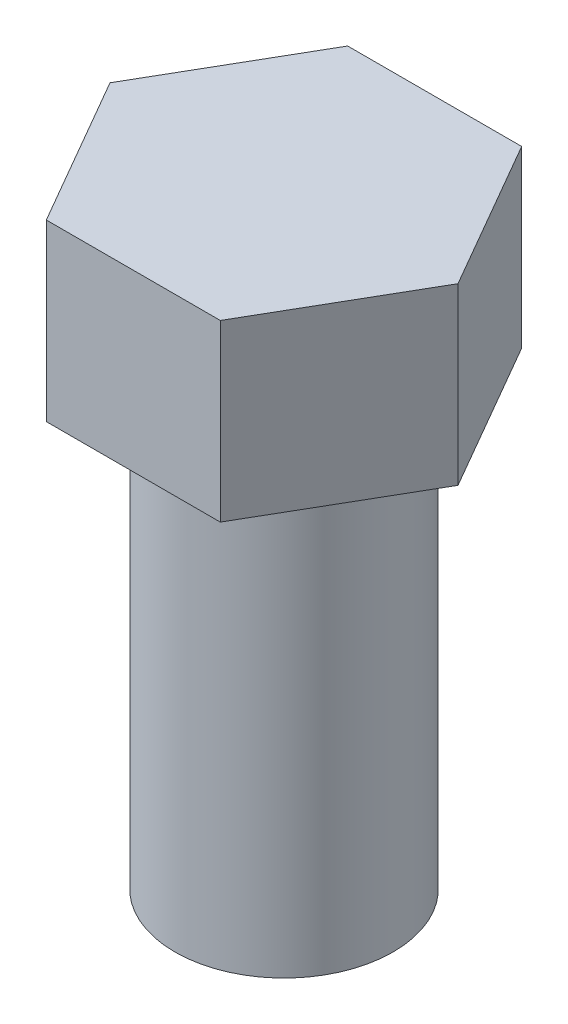
ISO-10303-21;
HEADER;
FILE_DESCRIPTION(('STEP AP214'),'2;1');
FILE_NAME('part.step','',(''),(''),'','','');
FILE_SCHEMA(('AUTOMOTIVE_DESIGN { 1 0 10303 214 1 1 1 1 }'));
ENDSEC;
DATA;
#1=APPLICATION_CONTEXT('core data for automotive mechanical design processes');
#2=APPLICATION_PROTOCOL_DEFINITION('international standard','automotive_design',2000,#1);
#3=PRODUCT_CONTEXT('',#1,'mechanical');
#4=PRODUCT('Part','Part','',(#3));
#5=PRODUCT_RELATED_PRODUCT_CATEGORY('part','',(#4));
#6=PRODUCT_DEFINITION_FORMATION('','',#4);
#7=PRODUCT_DEFINITION_CONTEXT('part definition',#1,'design');
#8=PRODUCT_DEFINITION('design','',#6,#7);
#9=PRODUCT_DEFINITION_SHAPE('','',#8);
#10=(LENGTH_UNIT() NAMED_UNIT(*) SI_UNIT(.MILLI.,.METRE.));
#11=(NAMED_UNIT(*) PLANE_ANGLE_UNIT() SI_UNIT($,.RADIAN.));
#12=(NAMED_UNIT(*) SI_UNIT($,.STERADIAN.) SOLID_ANGLE_UNIT());
#13=UNCERTAINTY_MEASURE_WITH_UNIT(LENGTH_MEASURE(1.E-05),#10,'distance_accuracy_value','');
#14=(GEOMETRIC_REPRESENTATION_CONTEXT(3) GLOBAL_UNCERTAINTY_ASSIGNED_CONTEXT((#13)) GLOBAL_UNIT_ASSIGNED_CONTEXT((#10,
#11,#12)) REPRESENTATION_CONTEXT('',''));
#15=CARTESIAN_POINT('',(0.,0.,0.));
#16=DIRECTION('',(0.,0.,1.));
#17=DIRECTION('',(1.,0.,0.));
#18=AXIS2_PLACEMENT_3D('',#15,#16,#17);
#19=CARTESIAN_POINT('',(0.,-254.,0.));
#20=DIRECTION('',(0.,1.,0.));
#21=DIRECTION('',(0.,0.,1.));
#22=AXIS2_PLACEMENT_3D('',#19,#20,#21);
#23=CYLINDRICAL_SURFACE('',#22,63.5);
#24=CARTESIAN_POINT('',(0.,-254.,0.));
#25=DIRECTION('',(0.,1.,0.));
#26=DIRECTION('',(0.,0.,1.));
#27=AXIS2_PLACEMENT_3D('',#24,#25,#26);
#28=CIRCLE('',#27,63.5);
#29=CARTESIAN_POINT('',(0.,-254.,63.5));
#30=VERTEX_POINT('',#29);
#31=EDGE_CURVE('E13',#30,#30,#28,.T.);
#32=ORIENTED_EDGE('',*,*,#31,.T.);
#33=EDGE_LOOP('',(#32));
#34=FACE_BOUND('',#33,.T.);
#35=CARTESIAN_POINT('',(0.,0.,0.));
#36=DIRECTION('',(0.,1.,0.));
#37=DIRECTION('',(0.,0.,1.));
#38=AXIS2_PLACEMENT_3D('',#35,#36,#37);
#39=CIRCLE('',#38,63.5);
#40=CARTESIAN_POINT('',(0.,0.,63.5));
#41=VERTEX_POINT('',#40);
#42=EDGE_CURVE('E47',#41,#41,#39,.T.);
#43=ORIENTED_EDGE('',*,*,#42,.F.);
#44=EDGE_LOOP('',(#43));
#45=FACE_BOUND('',#44,.T.);
#46=ADVANCED_FACE('F44',(#34,#45),#23,.T.);
#47=CARTESIAN_POINT('',(0.,-254.,0.));
#48=DIRECTION('',(0.,1.,0.));
#49=DIRECTION('',(0.,0.,1.));
#50=AXIS2_PLACEMENT_3D('',#47,#48,#49);
#51=PLANE('',#50);
#52=ORIENTED_EDGE('',*,*,#31,.F.);
#53=EDGE_LOOP('',(#52));
#54=FACE_BOUND('',#53,.T.);
#55=ADVANCED_FACE('F155',(#54),#51,.F.);
#56=CARTESIAN_POINT('',(-101.227340711628,101.6,0.));
#57=DIRECTION('',(0.866025403784439,0.,0.5));
#58=DIRECTION('',(0.5,0.,-0.866025403784439));
#59=AXIS2_PLACEMENT_3D('',#56,#57,#58);
#60=PLANE('',#59);
#61=DIRECTION('',(-0.5,0.,0.866025403784439));
#62=VECTOR('',#61,1.);
#63=CARTESIAN_POINT('',(-101.227340711628,0.,0.));
#64=LINE('',#63,#62);
#65=CARTESIAN_POINT('',(-50.6136703558138,0.,-87.6654486138122));
#66=VERTEX_POINT('',#65);
#67=CARTESIAN_POINT('',(-101.227340711628,0.,0.));
#68=VERTEX_POINT('',#67);
#69=EDGE_CURVE('E129',#66,#68,#64,.T.);
#70=ORIENTED_EDGE('',*,*,#69,.T.);
#71=DIRECTION('',(0.,-1.,0.));
#72=VECTOR('',#71,1.);
#73=CARTESIAN_POINT('',(-101.227340711628,101.6,0.));
#74=LINE('',#73,#72);
#75=CARTESIAN_POINT('',(-101.227340711628,101.6,0.));
#76=VERTEX_POINT('',#75);
#77=EDGE_CURVE('E146',#76,#68,#74,.T.);
#78=ORIENTED_EDGE('',*,*,#77,.F.);
#79=DIRECTION('',(-0.5,0.,0.866025403784439));
#80=VECTOR('',#79,1.);
#81=CARTESIAN_POINT('',(-101.227340711628,101.6,0.));
#82=LINE('',#81,#80);
#83=CARTESIAN_POINT('',(-50.6136703558138,101.6,-87.6654486138122));
#84=VERTEX_POINT('',#83);
#85=EDGE_CURVE('E139',#84,#76,#82,.T.);
#86=ORIENTED_EDGE('',*,*,#85,.F.);
#87=DIRECTION('',(0.,-1.,0.));
#88=VECTOR('',#87,1.);
#89=CARTESIAN_POINT('',(-50.6136703558138,101.6,-87.6654486138122));
#90=LINE('',#89,#88);
#91=EDGE_CURVE('E125',#84,#66,#90,.T.);
#92=ORIENTED_EDGE('',*,*,#91,.T.);
#93=EDGE_LOOP('',(#70,#78,#86,#92));
#94=FACE_BOUND('',#93,.T.);
#95=ADVANCED_FACE('F160',(#94),#60,.F.);
#96=CARTESIAN_POINT('',(-50.6136703558138,101.6,87.6654486138122));
#97=DIRECTION('',(0.866025403784439,0.,-0.5));
#98=DIRECTION('',(-0.5,0.,-0.866025403784439));
#99=AXIS2_PLACEMENT_3D('',#96,#97,#98);
#100=PLANE('',#99);
#101=DIRECTION('',(0.5,0.,0.866025403784439));
#102=VECTOR('',#101,1.);
#103=CARTESIAN_POINT('',(-50.6136703558138,0.,87.6654486138122));
#104=LINE('',#103,#102);
#105=CARTESIAN_POINT('',(-50.6136703558138,0.,87.6654486138122));
#106=VERTEX_POINT('',#105);
#107=EDGE_CURVE('E132',#68,#106,#104,.T.);
#108=ORIENTED_EDGE('',*,*,#107,.T.);
#109=DIRECTION('',(0.,-1.,0.));
#110=VECTOR('',#109,1.);
#111=CARTESIAN_POINT('',(-50.6136703558138,101.6,87.6654486138122));
#112=LINE('',#111,#110);
#113=CARTESIAN_POINT('',(-50.6136703558138,101.6,87.6654486138122));
#114=VERTEX_POINT('',#113);
#115=EDGE_CURVE('E143',#114,#106,#112,.T.);
#116=ORIENTED_EDGE('',*,*,#115,.F.);
#117=DIRECTION('',(0.5,0.,0.866025403784439));
#118=VECTOR('',#117,1.);
#119=CARTESIAN_POINT('',(-50.6136703558138,101.6,87.6654486138122));
#120=LINE('',#119,#118);
#121=EDGE_CURVE('E98',#76,#114,#120,.T.);
#122=ORIENTED_EDGE('',*,*,#121,.F.);
#123=ORIENTED_EDGE('',*,*,#77,.T.);
#124=EDGE_LOOP('',(#108,#116,#122,#123));
#125=FACE_BOUND('',#124,.T.);
#126=ADVANCED_FACE('F166',(#125),#100,.F.);
#127=CARTESIAN_POINT('',(50.6136703558138,101.6,87.6654486138122));
#128=DIRECTION('',(0.,0.,-1.));
#129=DIRECTION('',(-1.,0.,0.));
#130=AXIS2_PLACEMENT_3D('',#127,#128,#129);
#131=PLANE('',#130);
#132=DIRECTION('',(1.,0.,0.));
#133=VECTOR('',#132,1.);
#134=CARTESIAN_POINT('',(50.6136703558138,0.,87.6654486138122));
#135=LINE('',#134,#133);
#136=CARTESIAN_POINT('',(50.6136703558138,0.,87.6654486138122));
#137=VERTEX_POINT('',#136);
#138=EDGE_CURVE('E134',#106,#137,#135,.T.);
#139=ORIENTED_EDGE('',*,*,#138,.T.);
#140=DIRECTION('',(0.,-1.,0.));
#141=VECTOR('',#140,1.);
#142=CARTESIAN_POINT('',(50.6136703558138,101.6,87.6654486138122));
#143=LINE('',#142,#141);
#144=CARTESIAN_POINT('',(50.6136703558138,101.6,87.6654486138122));
#145=VERTEX_POINT('',#144);
#146=EDGE_CURVE('E120',#145,#137,#143,.T.);
#147=ORIENTED_EDGE('',*,*,#146,.F.);
#148=DIRECTION('',(1.,0.,0.));
#149=VECTOR('',#148,1.);
#150=CARTESIAN_POINT('',(50.6136703558138,101.6,87.6654486138122));
#151=LINE('',#150,#149);
#152=EDGE_CURVE('E111',#114,#145,#151,.T.);
#153=ORIENTED_EDGE('',*,*,#152,.F.);
#154=ORIENTED_EDGE('',*,*,#115,.T.);
#155=EDGE_LOOP('',(#139,#147,#153,#154));
#156=FACE_BOUND('',#155,.T.);
#157=ADVANCED_FACE('F172',(#156),#131,.F.);
#158=CARTESIAN_POINT('',(101.227340711628,101.6,0.));
#159=DIRECTION('',(-0.866025403784439,0.,-0.5));
#160=DIRECTION('',(-0.5,0.,0.866025403784439));
#161=AXIS2_PLACEMENT_3D('',#158,#159,#160);
#162=PLANE('',#161);
#163=DIRECTION('',(0.5,0.,-0.866025403784438));
#164=VECTOR('',#163,1.);
#165=CARTESIAN_POINT('',(101.227340711628,0.,0.));
#166=LINE('',#165,#164);
#167=CARTESIAN_POINT('',(101.227340711628,0.,0.));
#168=VERTEX_POINT('',#167);
#169=EDGE_CURVE('E119',#137,#168,#166,.T.);
#170=ORIENTED_EDGE('',*,*,#169,.T.);
#171=DIRECTION('',(0.,-1.,0.));
#172=VECTOR('',#171,1.);
#173=CARTESIAN_POINT('',(101.227340711628,101.6,0.));
#174=LINE('',#173,#172);
#175=CARTESIAN_POINT('',(101.227340711628,101.6,0.));
#176=VERTEX_POINT('',#175);
#177=EDGE_CURVE('E116',#176,#168,#174,.T.);
#178=ORIENTED_EDGE('',*,*,#177,.F.);
#179=DIRECTION('',(0.5,0.,-0.866025403784438));
#180=VECTOR('',#179,1.);
#181=CARTESIAN_POINT('',(101.227340711628,101.6,0.));
#182=LINE('',#181,#180);
#183=EDGE_CURVE('E105',#145,#176,#182,.T.);
#184=ORIENTED_EDGE('',*,*,#183,.F.);
#185=ORIENTED_EDGE('',*,*,#146,.T.);
#186=EDGE_LOOP('',(#170,#178,#184,#185));
#187=FACE_BOUND('',#186,.T.);
#188=ADVANCED_FACE('F117',(#187),#162,.F.);
#189=CARTESIAN_POINT('',(50.6136703558138,101.6,-87.6654486138122));
#190=DIRECTION('',(-0.866025403784439,0.,0.5));
#191=DIRECTION('',(0.5,0.,0.866025403784439));
#192=AXIS2_PLACEMENT_3D('',#189,#190,#191);
#193=PLANE('',#192);
#194=DIRECTION('',(-0.5,0.,-0.866025403784439));
#195=VECTOR('',#194,1.);
#196=CARTESIAN_POINT('',(50.6136703558138,0.,-87.6654486138122));
#197=LINE('',#196,#195);
#198=CARTESIAN_POINT('',(50.6136703558138,0.,-87.6654486138122));
#199=VERTEX_POINT('',#198);
#200=EDGE_CURVE('E83',#168,#199,#197,.T.);
#201=ORIENTED_EDGE('',*,*,#200,.T.);
#202=DIRECTION('',(0.,-1.,0.));
#203=VECTOR('',#202,1.);
#204=CARTESIAN_POINT('',(50.6136703558138,101.6,-87.6654486138122));
#205=LINE('',#204,#203);
#206=CARTESIAN_POINT('',(50.6136703558138,101.6,-87.6654486138122));
#207=VERTEX_POINT('',#206);
#208=EDGE_CURVE('E121',#207,#199,#205,.T.);
#209=ORIENTED_EDGE('',*,*,#208,.F.);
#210=DIRECTION('',(-0.5,0.,-0.866025403784439));
#211=VECTOR('',#210,1.);
#212=CARTESIAN_POINT('',(50.6136703558138,101.6,-87.6654486138122));
#213=LINE('',#212,#211);
#214=EDGE_CURVE('E109',#176,#207,#213,.T.);
#215=ORIENTED_EDGE('',*,*,#214,.F.);
#216=ORIENTED_EDGE('',*,*,#177,.T.);
#217=EDGE_LOOP('',(#201,#209,#215,#216));
#218=FACE_BOUND('',#217,.T.);
#219=ADVANCED_FACE('F123',(#218),#193,.F.);
#220=CARTESIAN_POINT('',(-50.6136703558138,101.6,-87.6654486138122));
#221=DIRECTION('',(0.,0.,1.));
#222=DIRECTION('',(1.,0.,0.));
#223=AXIS2_PLACEMENT_3D('',#220,#221,#222);
#224=PLANE('',#223);
#225=DIRECTION('',(-1.,0.,0.));
#226=VECTOR('',#225,1.);
#227=CARTESIAN_POINT('',(-50.6136703558138,0.,-87.6654486138122));
#228=LINE('',#227,#226);
#229=EDGE_CURVE('E89',#199,#66,#228,.T.);
#230=ORIENTED_EDGE('',*,*,#229,.T.);
#231=ORIENTED_EDGE('',*,*,#91,.F.);
#232=DIRECTION('',(-1.,0.,0.));
#233=VECTOR('',#232,1.);
#234=CARTESIAN_POINT('',(-50.6136703558138,101.6,-87.6654486138122));
#235=LINE('',#234,#233);
#236=EDGE_CURVE('E60',#207,#84,#235,.T.);
#237=ORIENTED_EDGE('',*,*,#236,.F.);
#238=ORIENTED_EDGE('',*,*,#208,.T.);
#239=EDGE_LOOP('',(#230,#231,#237,#238));
#240=FACE_BOUND('',#239,.T.);
#241=ADVANCED_FACE('F180',(#240),#224,.F.);
#242=CARTESIAN_POINT('',(0.,101.6,0.));
#243=DIRECTION('',(0.,-1.,0.));
#244=DIRECTION('',(0.,0.,-1.));
#245=AXIS2_PLACEMENT_3D('',#242,#243,#244);
#246=PLANE('',#245);
#247=ORIENTED_EDGE('',*,*,#85,.T.);
#248=ORIENTED_EDGE('',*,*,#121,.T.);
#249=ORIENTED_EDGE('',*,*,#152,.T.);
#250=ORIENTED_EDGE('',*,*,#183,.T.);
#251=ORIENTED_EDGE('',*,*,#214,.T.);
#252=ORIENTED_EDGE('',*,*,#236,.T.);
#253=EDGE_LOOP('',(#247,#248,#249,#250,#251,#252));
#254=FACE_BOUND('',#253,.T.);
#255=ADVANCED_FACE('F107',(#254),#246,.F.);
#256=CARTESIAN_POINT('',(0.,0.,0.));
#257=DIRECTION('',(0.,-1.,0.));
#258=DIRECTION('',(0.,0.,-1.));
#259=AXIS2_PLACEMENT_3D('',#256,#257,#258);
#260=PLANE('',#259);
#261=ORIENTED_EDGE('',*,*,#42,.T.);
#262=EDGE_LOOP('',(#261));
#263=FACE_BOUND('',#262,.T.);
#264=ORIENTED_EDGE('',*,*,#69,.F.);
#265=ORIENTED_EDGE('',*,*,#229,.F.);
#266=ORIENTED_EDGE('',*,*,#200,.F.);
#267=ORIENTED_EDGE('',*,*,#169,.F.);
#268=ORIENTED_EDGE('',*,*,#138,.F.);
#269=ORIENTED_EDGE('',*,*,#107,.F.);
#270=EDGE_LOOP('',(#264,#265,#266,#267,#268,#269));
#271=FACE_BOUND('',#270,.T.);
#272=ADVANCED_FACE('F151',(#263,#271),#260,.T.);
#273=CLOSED_SHELL('',(#46,#55,#95,#126,#157,#188,#219,#241,#255,#272));
#274=MANIFOLD_SOLID_BREP('B2',#273);
#275=ADVANCED_BREP_SHAPE_REPRESENTATION('',(#18,#274),#14);
#276=SHAPE_DEFINITION_REPRESENTATION(#9,#275);
ENDSEC;
END-ISO-10303-21;
